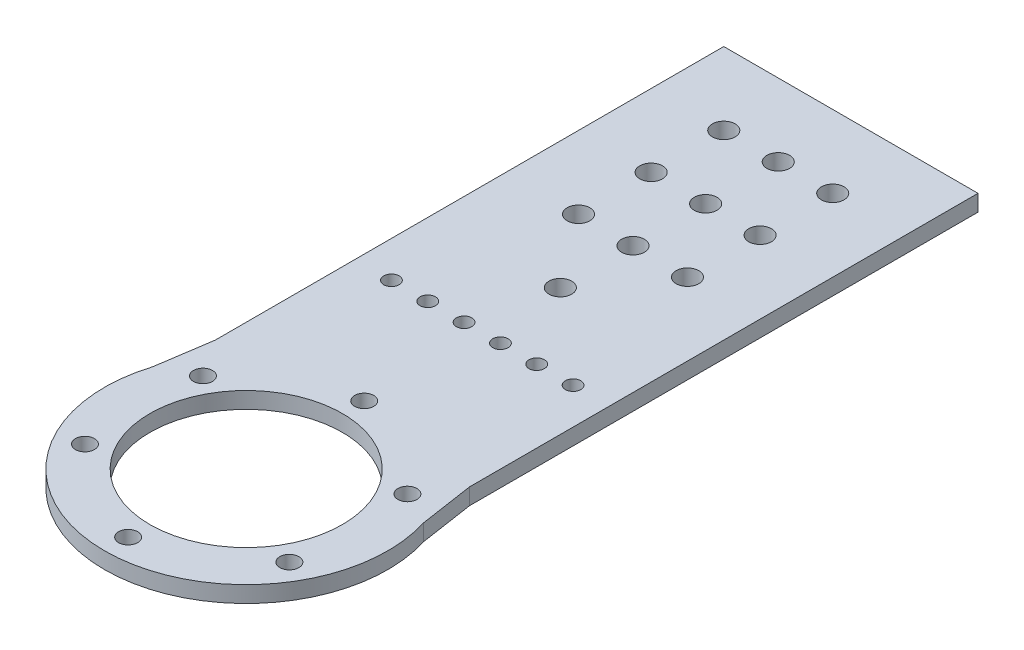
ISO-10303-21;
HEADER;
FILE_DESCRIPTION(('STEP AP214'),'2;1');
FILE_NAME('part.step','',(''),(''),'','','');
FILE_SCHEMA(('AUTOMOTIVE_DESIGN { 1 0 10303 214 1 1 1 1 }'));
ENDSEC;
DATA;
#1=APPLICATION_CONTEXT('core data for automotive mechanical design processes');
#2=APPLICATION_PROTOCOL_DEFINITION('international standard','automotive_design',2000,#1);
#3=PRODUCT_CONTEXT('',#1,'mechanical');
#4=PRODUCT('Part','Part','',(#3));
#5=PRODUCT_RELATED_PRODUCT_CATEGORY('part','',(#4));
#6=PRODUCT_DEFINITION_FORMATION('','',#4);
#7=PRODUCT_DEFINITION_CONTEXT('part definition',#1,'design');
#8=PRODUCT_DEFINITION('design','',#6,#7);
#9=PRODUCT_DEFINITION_SHAPE('','',#8);
#10=(LENGTH_UNIT() NAMED_UNIT(*) SI_UNIT(.MILLI.,.METRE.));
#11=(NAMED_UNIT(*) PLANE_ANGLE_UNIT() SI_UNIT($,.RADIAN.));
#12=(NAMED_UNIT(*) SI_UNIT($,.STERADIAN.) SOLID_ANGLE_UNIT());
#13=UNCERTAINTY_MEASURE_WITH_UNIT(LENGTH_MEASURE(1.E-05),#10,'distance_accuracy_value','');
#14=(GEOMETRIC_REPRESENTATION_CONTEXT(3) GLOBAL_UNCERTAINTY_ASSIGNED_CONTEXT((#13)) GLOBAL_UNIT_ASSIGNED_CONTEXT((#10,
#11,#12)) REPRESENTATION_CONTEXT('',''));
#15=CARTESIAN_POINT('',(0.,0.,0.));
#16=DIRECTION('',(0.,0.,1.));
#17=DIRECTION('',(1.,0.,0.));
#18=AXIS2_PLACEMENT_3D('',#15,#16,#17);
#19=CARTESIAN_POINT('',(5.,-2.25,-65.));
#20=DIRECTION('',(0.,1.,0.));
#21=DIRECTION('',(0.,0.,1.));
#22=AXIS2_PLACEMENT_3D('',#19,#20,#21);
#23=CYLINDRICAL_SURFACE('',#22,2.125);
#24=CARTESIAN_POINT('',(5.,2.25,-65.));
#25=DIRECTION('',(0.,1.,0.));
#26=DIRECTION('',(0.,0.,1.));
#27=AXIS2_PLACEMENT_3D('',#24,#25,#26);
#28=CIRCLE('',#27,2.125);
#29=CARTESIAN_POINT('',(5.,2.25,-62.875));
#30=VERTEX_POINT('',#29);
#31=EDGE_CURVE('E40',#30,#30,#28,.T.);
#32=ORIENTED_EDGE('',*,*,#31,.T.);
#33=EDGE_LOOP('',(#32));
#34=FACE_BOUND('',#33,.T.);
#35=CARTESIAN_POINT('',(5.,-2.25,-65.));
#36=DIRECTION('',(0.,1.,0.));
#37=DIRECTION('',(0.,0.,1.));
#38=AXIS2_PLACEMENT_3D('',#35,#36,#37);
#39=CIRCLE('',#38,2.125);
#40=CARTESIAN_POINT('',(5.,-2.25,-62.875));
#41=VERTEX_POINT('',#40);
#42=EDGE_CURVE('E11',#41,#41,#39,.T.);
#43=ORIENTED_EDGE('',*,*,#42,.F.);
#44=EDGE_LOOP('',(#43));
#45=FACE_BOUND('',#44,.T.);
#46=ADVANCED_FACE('F33',(#34,#45),#23,.F.);
#47=CARTESIAN_POINT('',(0.,-7.75,-86.5000000000001));
#48=DIRECTION('',(0.,1.,0.));
#49=DIRECTION('',(0.,0.,1.));
#50=AXIS2_PLACEMENT_3D('',#47,#48,#49);
#51=CYLINDRICAL_SURFACE('',#50,3.125);
#52=CARTESIAN_POINT('',(0.,2.25,-86.5000000000001));
#53=DIRECTION('',(0.,1.,0.));
#54=DIRECTION('',(0.,0.,1.));
#55=AXIS2_PLACEMENT_3D('',#52,#53,#54);
#56=CIRCLE('',#55,3.125);
#57=CARTESIAN_POINT('',(0.,2.25,-83.3750000000001));
#58=VERTEX_POINT('',#57);
#59=EDGE_CURVE('E150',#58,#58,#56,.T.);
#60=ORIENTED_EDGE('',*,*,#59,.T.);
#61=EDGE_LOOP('',(#60));
#62=FACE_BOUND('',#61,.T.);
#63=CARTESIAN_POINT('',(0.,-2.25,-86.5000000000001));
#64=DIRECTION('',(0.,1.,0.));
#65=DIRECTION('',(0.,0.,1.));
#66=AXIS2_PLACEMENT_3D('',#63,#64,#65);
#67=CIRCLE('',#66,3.125);
#68=CARTESIAN_POINT('',(0.,-2.25,-83.3750000000001));
#69=VERTEX_POINT('',#68);
#70=EDGE_CURVE('E153',#69,#69,#67,.T.);
#71=ORIENTED_EDGE('',*,*,#70,.F.);
#72=EDGE_LOOP('',(#71));
#73=FACE_BOUND('',#72,.T.);
#74=ADVANCED_FACE('F178',(#62,#73),#51,.F.);
#75=CARTESIAN_POINT('',(0.,-7.75,-106.5));
#76=DIRECTION('',(0.,1.,0.));
#77=DIRECTION('',(0.,0.,1.));
#78=AXIS2_PLACEMENT_3D('',#75,#76,#77);
#79=CYLINDRICAL_SURFACE('',#78,3.125);
#80=CARTESIAN_POINT('',(0.,2.25,-106.5));
#81=DIRECTION('',(0.,1.,0.));
#82=DIRECTION('',(0.,0.,1.));
#83=AXIS2_PLACEMENT_3D('',#80,#81,#82);
#84=CIRCLE('',#83,3.125);
#85=CARTESIAN_POINT('',(0.,2.25,-103.375));
#86=VERTEX_POINT('',#85);
#87=EDGE_CURVE('E139',#86,#86,#84,.T.);
#88=ORIENTED_EDGE('',*,*,#87,.T.);
#89=EDGE_LOOP('',(#88));
#90=FACE_BOUND('',#89,.T.);
#91=CARTESIAN_POINT('',(0.,-2.25,-106.5));
#92=DIRECTION('',(0.,1.,0.));
#93=DIRECTION('',(0.,0.,1.));
#94=AXIS2_PLACEMENT_3D('',#91,#92,#93);
#95=CIRCLE('',#94,3.125);
#96=CARTESIAN_POINT('',(0.,-2.25,-103.375));
#97=VERTEX_POINT('',#96);
#98=EDGE_CURVE('E147',#97,#97,#95,.T.);
#99=ORIENTED_EDGE('',*,*,#98,.F.);
#100=EDGE_LOOP('',(#99));
#101=FACE_BOUND('',#100,.T.);
#102=ADVANCED_FACE('F182',(#90,#101),#79,.F.);
#103=CARTESIAN_POINT('',(15.,-2.25,-106.5));
#104=DIRECTION('',(0.,1.,0.));
#105=DIRECTION('',(0.,0.,1.));
#106=AXIS2_PLACEMENT_3D('',#103,#104,#105);
#107=CYLINDRICAL_SURFACE('',#106,3.125);
#108=CARTESIAN_POINT('',(15.,2.25,-106.5));
#109=DIRECTION('',(0.,1.,0.));
#110=DIRECTION('',(0.,0.,1.));
#111=AXIS2_PLACEMENT_3D('',#108,#109,#110);
#112=CIRCLE('',#111,3.125);
#113=CARTESIAN_POINT('',(15.,2.25,-103.375));
#114=VERTEX_POINT('',#113);
#115=EDGE_CURVE('E133',#114,#114,#112,.T.);
#116=ORIENTED_EDGE('',*,*,#115,.T.);
#117=EDGE_LOOP('',(#116));
#118=FACE_BOUND('',#117,.T.);
#119=CARTESIAN_POINT('',(15.,-2.25,-106.5));
#120=DIRECTION('',(0.,1.,0.));
#121=DIRECTION('',(0.,0.,1.));
#122=AXIS2_PLACEMENT_3D('',#119,#120,#121);
#123=CIRCLE('',#122,3.125);
#124=CARTESIAN_POINT('',(15.,-2.25,-103.375));
#125=VERTEX_POINT('',#124);
#126=EDGE_CURVE('E136',#125,#125,#123,.T.);
#127=ORIENTED_EDGE('',*,*,#126,.F.);
#128=EDGE_LOOP('',(#127));
#129=FACE_BOUND('',#128,.T.);
#130=ADVANCED_FACE('F187',(#118,#129),#107,.F.);
#131=CARTESIAN_POINT('',(-15.,-2.25,-106.5));
#132=DIRECTION('',(0.,1.,0.));
#133=DIRECTION('',(0.,0.,1.));
#134=AXIS2_PLACEMENT_3D('',#131,#132,#133);
#135=CYLINDRICAL_SURFACE('',#134,3.125);
#136=CARTESIAN_POINT('',(-15.,2.25,-106.5));
#137=DIRECTION('',(0.,1.,0.));
#138=DIRECTION('',(0.,0.,1.));
#139=AXIS2_PLACEMENT_3D('',#136,#137,#138);
#140=CIRCLE('',#139,3.125);
#141=CARTESIAN_POINT('',(-15.,2.25,-103.375));
#142=VERTEX_POINT('',#141);
#143=EDGE_CURVE('E126',#142,#142,#140,.T.);
#144=ORIENTED_EDGE('',*,*,#143,.T.);
#145=EDGE_LOOP('',(#144));
#146=FACE_BOUND('',#145,.T.);
#147=CARTESIAN_POINT('',(-15.,-2.25,-106.5));
#148=DIRECTION('',(0.,1.,0.));
#149=DIRECTION('',(0.,0.,1.));
#150=AXIS2_PLACEMENT_3D('',#147,#148,#149);
#151=CIRCLE('',#150,3.125);
#152=CARTESIAN_POINT('',(-15.,-2.25,-103.375));
#153=VERTEX_POINT('',#152);
#154=EDGE_CURVE('E130',#153,#153,#151,.T.);
#155=ORIENTED_EDGE('',*,*,#154,.F.);
#156=EDGE_LOOP('',(#155));
#157=FACE_BOUND('',#156,.T.);
#158=ADVANCED_FACE('F172',(#146,#157),#135,.F.);
#159=CARTESIAN_POINT('',(0.,2.25,0.));
#160=DIRECTION('',(0.,-1.,0.));
#161=DIRECTION('',(0.,0.,-1.));
#162=AXIS2_PLACEMENT_3D('',#159,#160,#161);
#163=CYLINDRICAL_SURFACE('',#162,39.);
#164=DIRECTION('',(0.,-1.,0.));
#165=VECTOR('',#164,1.);
#166=CARTESIAN_POINT('',(37.262443438914,2.25,-11.5113122171946));
#167=LINE('',#166,#165);
#168=CARTESIAN_POINT('',(37.2624434389141,2.25,-11.5113122171945));
#169=VERTEX_POINT('',#168);
#170=CARTESIAN_POINT('',(37.2624434389141,-2.25,-11.5113122171945));
#171=VERTEX_POINT('',#170);
#172=EDGE_CURVE('E108',#169,#171,#167,.T.);
#173=ORIENTED_EDGE('',*,*,#172,.F.);
#174=CARTESIAN_POINT('',(0.,2.25,0.));
#175=DIRECTION('',(0.,1.,0.));
#176=DIRECTION('',(0.,0.,1.));
#177=AXIS2_PLACEMENT_3D('',#174,#175,#176);
#178=CIRCLE('',#177,39.);
#179=CARTESIAN_POINT('',(-37.262443438914,2.25,-11.5113122171946));
#180=VERTEX_POINT('',#179);
#181=EDGE_CURVE('E47',#180,#169,#178,.T.);
#182=ORIENTED_EDGE('',*,*,#181,.F.);
#183=DIRECTION('',(0.,-1.,0.));
#184=VECTOR('',#183,1.);
#185=CARTESIAN_POINT('',(-37.262443438914,2.25,-11.5113122171946));
#186=LINE('',#185,#184);
#187=CARTESIAN_POINT('',(-37.262443438914,-2.25,-11.5113122171946));
#188=VERTEX_POINT('',#187);
#189=EDGE_CURVE('E111',#188,#180,#186,.F.);
#190=ORIENTED_EDGE('',*,*,#189,.F.);
#191=CARTESIAN_POINT('',(0.,-2.25,0.));
#192=DIRECTION('',(0.,1.,0.));
#193=DIRECTION('',(0.,0.,1.));
#194=AXIS2_PLACEMENT_3D('',#191,#192,#193);
#195=CIRCLE('',#194,39.);
#196=EDGE_CURVE('E122',#188,#171,#195,.T.);
#197=ORIENTED_EDGE('',*,*,#196,.T.);
#198=EDGE_LOOP('',(#173,#182,#190,#197));
#199=FACE_BOUND('',#198,.T.);
#200=ADVANCED_FACE('F162',(#199),#163,.T.);
#201=CARTESIAN_POINT('',(0.,2.25,0.));
#202=DIRECTION('',(0.,1.,0.));
#203=DIRECTION('',(0.,0.,1.));
#204=AXIS2_PLACEMENT_3D('',#201,#202,#203);
#205=PLANE('',#204);
#206=CARTESIAN_POINT('',(-25.,2.25,-65.));
#207=DIRECTION('',(0.,1.,0.));
#208=DIRECTION('',(0.,0.,1.));
#209=AXIS2_PLACEMENT_3D('',#206,#207,#208);
#210=CIRCLE('',#209,2.125);
#211=CARTESIAN_POINT('',(-25.,2.25,-62.875));
#212=VERTEX_POINT('',#211);
#213=EDGE_CURVE('E481',#212,#212,#210,.F.);
#214=ORIENTED_EDGE('',*,*,#213,.T.);
#215=EDGE_LOOP('',(#214));
#216=FACE_BOUND('',#215,.T.);
#217=CARTESIAN_POINT('',(-15.,2.25,-65.));
#218=DIRECTION('',(0.,1.,0.));
#219=DIRECTION('',(0.,0.,1.));
#220=AXIS2_PLACEMENT_3D('',#217,#218,#219);
#221=CIRCLE('',#220,2.125);
#222=CARTESIAN_POINT('',(-15.,2.25,-62.875));
#223=VERTEX_POINT('',#222);
#224=EDGE_CURVE('E489',#223,#223,#221,.F.);
#225=ORIENTED_EDGE('',*,*,#224,.T.);
#226=EDGE_LOOP('',(#225));
#227=FACE_BOUND('',#226,.T.);
#228=CARTESIAN_POINT('',(-5.,2.25,-65.));
#229=DIRECTION('',(0.,1.,0.));
#230=DIRECTION('',(0.,0.,1.));
#231=AXIS2_PLACEMENT_3D('',#228,#229,#230);
#232=CIRCLE('',#231,2.125);
#233=CARTESIAN_POINT('',(-5.,2.25,-62.875));
#234=VERTEX_POINT('',#233);
#235=EDGE_CURVE('E485',#234,#234,#232,.F.);
#236=ORIENTED_EDGE('',*,*,#235,.T.);
#237=EDGE_LOOP('',(#236));
#238=FACE_BOUND('',#237,.T.);
#239=CARTESIAN_POINT('',(15.,2.25,-65.));
#240=DIRECTION('',(0.,1.,0.));
#241=DIRECTION('',(0.,0.,1.));
#242=AXIS2_PLACEMENT_3D('',#239,#240,#241);
#243=CIRCLE('',#242,2.125);
#244=CARTESIAN_POINT('',(15.,2.25,-62.875));
#245=VERTEX_POINT('',#244);
#246=EDGE_CURVE('E500',#245,#245,#243,.T.);
#247=ORIENTED_EDGE('',*,*,#246,.F.);
#248=EDGE_LOOP('',(#247));
#249=FACE_BOUND('',#248,.T.);
#250=CARTESIAN_POINT('',(25.,2.25,-65.));
#251=DIRECTION('',(0.,1.,0.));
#252=DIRECTION('',(0.,0.,1.));
#253=AXIS2_PLACEMENT_3D('',#250,#251,#252);
#254=CIRCLE('',#253,2.125);
#255=CARTESIAN_POINT('',(25.,2.25,-62.875));
#256=VERTEX_POINT('',#255);
#257=EDGE_CURVE('E509',#256,#256,#254,.T.);
#258=ORIENTED_EDGE('',*,*,#257,.F.);
#259=EDGE_LOOP('',(#258));
#260=FACE_BOUND('',#259,.T.);
#261=CARTESIAN_POINT('',(0.,2.25,-126.5));
#262=DIRECTION('',(0.,1.,0.));
#263=DIRECTION('',(0.,0.,1.));
#264=AXIS2_PLACEMENT_3D('',#261,#262,#263);
#265=CIRCLE('',#264,3.125);
#266=CARTESIAN_POINT('',(0.,2.25,-123.375));
#267=VERTEX_POINT('',#266);
#268=EDGE_CURVE('E512',#267,#267,#265,.T.);
#269=ORIENTED_EDGE('',*,*,#268,.F.);
#270=EDGE_LOOP('',(#269));
#271=FACE_BOUND('',#270,.T.);
#272=CARTESIAN_POINT('',(0.,2.25,-146.5));
#273=DIRECTION('',(0.,1.,0.));
#274=DIRECTION('',(0.,0.,1.));
#275=AXIS2_PLACEMENT_3D('',#272,#273,#274);
#276=CIRCLE('',#275,3.125);
#277=CARTESIAN_POINT('',(0.,2.25,-143.375));
#278=VERTEX_POINT('',#277);
#279=EDGE_CURVE('E144',#278,#278,#276,.T.);
#280=ORIENTED_EDGE('',*,*,#279,.F.);
#281=EDGE_LOOP('',(#280));
#282=FACE_BOUND('',#281,.T.);
#283=CARTESIAN_POINT('',(15.,2.25,-126.5));
#284=DIRECTION('',(0.,1.,0.));
#285=DIRECTION('',(0.,0.,1.));
#286=AXIS2_PLACEMENT_3D('',#283,#284,#285);
#287=CIRCLE('',#286,3.125);
#288=CARTESIAN_POINT('',(15.,2.25,-123.375));
#289=VERTEX_POINT('',#288);
#290=EDGE_CURVE('E143',#289,#289,#287,.T.);
#291=ORIENTED_EDGE('',*,*,#290,.F.);
#292=EDGE_LOOP('',(#291));
#293=FACE_BOUND('',#292,.T.);
#294=CARTESIAN_POINT('',(-15.,2.25,-126.5));
#295=DIRECTION('',(0.,1.,0.));
#296=DIRECTION('',(0.,0.,1.));
#297=AXIS2_PLACEMENT_3D('',#294,#295,#296);
#298=CIRCLE('',#297,3.125);
#299=CARTESIAN_POINT('',(-15.,2.25,-123.375));
#300=VERTEX_POINT('',#299);
#301=EDGE_CURVE('E525',#300,#300,#298,.T.);
#302=ORIENTED_EDGE('',*,*,#301,.F.);
#303=EDGE_LOOP('',(#302));
#304=FACE_BOUND('',#303,.T.);
#305=CARTESIAN_POINT('',(-15.,2.25,-146.5));
#306=DIRECTION('',(0.,1.,0.));
#307=DIRECTION('',(0.,0.,1.));
#308=AXIS2_PLACEMENT_3D('',#305,#306,#307);
#309=CIRCLE('',#308,3.125);
#310=CARTESIAN_POINT('',(-15.,2.25,-143.375));
#311=VERTEX_POINT('',#310);
#312=EDGE_CURVE('E540',#311,#311,#309,.T.);
#313=ORIENTED_EDGE('',*,*,#312,.F.);
#314=EDGE_LOOP('',(#313));
#315=FACE_BOUND('',#314,.T.);
#316=CARTESIAN_POINT('',(15.,2.25,-146.5));
#317=DIRECTION('',(0.,1.,0.));
#318=DIRECTION('',(0.,0.,1.));
#319=AXIS2_PLACEMENT_3D('',#316,#317,#318);
#320=CIRCLE('',#319,3.125);
#321=CARTESIAN_POINT('',(15.,2.25,-143.375));
#322=VERTEX_POINT('',#321);
#323=EDGE_CURVE('E535',#322,#322,#320,.T.);
#324=ORIENTED_EDGE('',*,*,#323,.F.);
#325=EDGE_LOOP('',(#324));
#326=FACE_BOUND('',#325,.T.);
#327=CARTESIAN_POINT('',(28.1458256229941,2.25,-16.2500000000003));
#328=DIRECTION('',(0.,1.,0.));
#329=DIRECTION('',(-0.866025403784433,0.,0.50000000000001));
#330=AXIS2_PLACEMENT_3D('',#327,#328,#329);
#331=CIRCLE('',#330,2.625);
#332=CARTESIAN_POINT('',(25.8725089380599,2.25,-14.9375000000003));
#333=VERTEX_POINT('',#332);
#334=EDGE_CURVE('E543',#333,#333,#331,.T.);
#335=ORIENTED_EDGE('',*,*,#334,.F.);
#336=EDGE_LOOP('',(#335));
#337=FACE_BOUND('',#336,.T.);
#338=CARTESIAN_POINT('',(28.1458256229944,2.25,16.2499999999997));
#339=DIRECTION('',(0.,1.,0.));
#340=DIRECTION('',(-0.866025403784443,0.,-0.499999999999992));
#341=AXIS2_PLACEMENT_3D('',#338,#339,#340);
#342=CIRCLE('',#341,2.625);
#343=CARTESIAN_POINT('',(25.8725089380602,2.25,14.9374999999998));
#344=VERTEX_POINT('',#343);
#345=EDGE_CURVE('E558',#344,#344,#342,.T.);
#346=ORIENTED_EDGE('',*,*,#345,.F.);
#347=EDGE_LOOP('',(#346));
#348=FACE_BOUND('',#347,.T.);
#349=CARTESIAN_POINT('',(0.,2.25,32.5));
#350=DIRECTION('',(0.,1.,0.));
#351=DIRECTION('',(0.,0.,-1.));
#352=AXIS2_PLACEMENT_3D('',#349,#350,#351);
#353=CIRCLE('',#352,2.625);
#354=CARTESIAN_POINT('',(0.,2.25,29.875));
#355=VERTEX_POINT('',#354);
#356=EDGE_CURVE('E552',#355,#355,#353,.T.);
#357=ORIENTED_EDGE('',*,*,#356,.F.);
#358=EDGE_LOOP('',(#357));
#359=FACE_BOUND('',#358,.T.);
#360=CARTESIAN_POINT('',(-28.1458256229942,2.25,16.2500000000001));
#361=DIRECTION('',(0.,1.,0.));
#362=DIRECTION('',(0.866025403784436,0.,-0.500000000000004));
#363=AXIS2_PLACEMENT_3D('',#360,#361,#362);
#364=CIRCLE('',#363,2.625);
#365=CARTESIAN_POINT('',(-25.87250893806,2.25,14.9375000000001));
#366=VERTEX_POINT('',#365);
#367=EDGE_CURVE('E544',#366,#366,#364,.T.);
#368=ORIENTED_EDGE('',*,*,#367,.F.);
#369=EDGE_LOOP('',(#368));
#370=FACE_BOUND('',#369,.T.);
#371=CARTESIAN_POINT('',(-28.1458256229943,2.25,-16.2499999999999));
#372=DIRECTION('',(0.,1.,0.));
#373=DIRECTION('',(0.86602540378444,0.,0.499999999999998));
#374=AXIS2_PLACEMENT_3D('',#371,#372,#373);
#375=CIRCLE('',#374,2.625);
#376=CARTESIAN_POINT('',(-25.8725089380601,2.25,-14.9374999999999));
#377=VERTEX_POINT('',#376);
#378=EDGE_CURVE('E551',#377,#377,#375,.T.);
#379=ORIENTED_EDGE('',*,*,#378,.F.);
#380=EDGE_LOOP('',(#379));
#381=FACE_BOUND('',#380,.T.);
#382=CARTESIAN_POINT('',(0.,2.25,-32.5));
#383=DIRECTION('',(0.,1.,0.));
#384=DIRECTION('',(0.,0.,1.));
#385=AXIS2_PLACEMENT_3D('',#382,#383,#384);
#386=CIRCLE('',#385,2.625);
#387=CARTESIAN_POINT('',(0.,2.25,-29.875));
#388=VERTEX_POINT('',#387);
#389=EDGE_CURVE('E573',#388,#388,#386,.T.);
#390=ORIENTED_EDGE('',*,*,#389,.F.);
#391=EDGE_LOOP('',(#390));
#392=FACE_BOUND('',#391,.T.);
#393=DIRECTION('',(-0.149252692330049,0.,0.988799086686588));
#394=VECTOR('',#393,1.);
#395=CARTESIAN_POINT('',(-35.,2.25,-26.5));
#396=LINE('',#395,#394);
#397=CARTESIAN_POINT('',(-35.,2.25,-26.5));
#398=VERTEX_POINT('',#397);
#399=EDGE_CURVE('E92',#398,#180,#396,.T.);
#400=ORIENTED_EDGE('',*,*,#399,.T.);
#401=ORIENTED_EDGE('',*,*,#181,.T.);
#402=DIRECTION('',(-0.149252692330051,0.,-0.988799086686588));
#403=VECTOR('',#402,1.);
#404=CARTESIAN_POINT('',(35.,2.25,-26.5));
#405=LINE('',#404,#403);
#406=CARTESIAN_POINT('',(35.,2.25,-26.5));
#407=VERTEX_POINT('',#406);
#408=EDGE_CURVE('E580',#169,#407,#405,.T.);
#409=ORIENTED_EDGE('',*,*,#408,.T.);
#410=DIRECTION('',(0.,0.,-1.));
#411=VECTOR('',#410,1.);
#412=CARTESIAN_POINT('',(35.,2.25,-166.5));
#413=LINE('',#412,#411);
#414=CARTESIAN_POINT('',(35.,2.25,-166.5));
#415=VERTEX_POINT('',#414);
#416=EDGE_CURVE('E99',#407,#415,#413,.T.);
#417=ORIENTED_EDGE('',*,*,#416,.T.);
#418=DIRECTION('',(-1.,0.,0.));
#419=VECTOR('',#418,1.);
#420=CARTESIAN_POINT('',(-35.,2.25,-166.5));
#421=LINE('',#420,#419);
#422=CARTESIAN_POINT('',(-35.,2.25,-166.5));
#423=VERTEX_POINT('',#422);
#424=EDGE_CURVE('E93',#415,#423,#421,.T.);
#425=ORIENTED_EDGE('',*,*,#424,.T.);
#426=DIRECTION('',(0.,0.,1.));
#427=VECTOR('',#426,1.);
#428=CARTESIAN_POINT('',(-35.,2.25,-166.5));
#429=LINE('',#428,#427);
#430=EDGE_CURVE('E83',#423,#398,#429,.T.);
#431=ORIENTED_EDGE('',*,*,#430,.T.);
#432=EDGE_LOOP('',(#400,#401,#409,#417,#425,#431));
#433=FACE_BOUND('',#432,.T.);
#434=CARTESIAN_POINT('',(0.,2.25,0.));
#435=DIRECTION('',(0.,1.,0.));
#436=DIRECTION('',(0.,0.,1.));
#437=AXIS2_PLACEMENT_3D('',#434,#435,#436);
#438=CIRCLE('',#437,26.5);
#439=CARTESIAN_POINT('',(0.,2.25,26.5));
#440=VERTEX_POINT('',#439);
#441=EDGE_CURVE('E119',#440,#440,#438,.T.);
#442=ORIENTED_EDGE('',*,*,#441,.F.);
#443=EDGE_LOOP('',(#442));
#444=FACE_BOUND('',#443,.T.);
#445=ORIENTED_EDGE('',*,*,#143,.F.);
#446=EDGE_LOOP('',(#445));
#447=FACE_BOUND('',#446,.T.);
#448=ORIENTED_EDGE('',*,*,#115,.F.);
#449=EDGE_LOOP('',(#448));
#450=FACE_BOUND('',#449,.T.);
#451=ORIENTED_EDGE('',*,*,#87,.F.);
#452=EDGE_LOOP('',(#451));
#453=FACE_BOUND('',#452,.T.);
#454=ORIENTED_EDGE('',*,*,#59,.F.);
#455=EDGE_LOOP('',(#454));
#456=FACE_BOUND('',#455,.T.);
#457=ORIENTED_EDGE('',*,*,#31,.F.);
#458=EDGE_LOOP('',(#457));
#459=FACE_BOUND('',#458,.T.);
#460=ADVANCED_FACE('F96',(#216,#227,#238,#249,#260,#271,#282,#293,#304,#315,#326,#337,#348,#359,
#370,#381,#392,#433,#444,#447,#450,#453,#456,#459),#205,.T.);
#461=CARTESIAN_POINT('',(0.,-2.25,0.));
#462=DIRECTION('',(0.,1.,0.));
#463=DIRECTION('',(0.,0.,1.));
#464=AXIS2_PLACEMENT_3D('',#461,#462,#463);
#465=PLANE('',#464);
#466=CARTESIAN_POINT('',(-25.,-2.25,-65.));
#467=DIRECTION('',(0.,-1.,0.));
#468=DIRECTION('',(0.,0.,1.));
#469=AXIS2_PLACEMENT_3D('',#466,#467,#468);
#470=CIRCLE('',#469,2.125);
#471=CARTESIAN_POINT('',(-25.,-2.25,-62.875));
#472=VERTEX_POINT('',#471);
#473=EDGE_CURVE('E484',#472,#472,#470,.T.);
#474=ORIENTED_EDGE('',*,*,#473,.F.);
#475=EDGE_LOOP('',(#474));
#476=FACE_BOUND('',#475,.T.);
#477=CARTESIAN_POINT('',(-15.,-2.25,-65.));
#478=DIRECTION('',(0.,-1.,0.));
#479=DIRECTION('',(0.,0.,1.));
#480=AXIS2_PLACEMENT_3D('',#477,#478,#479);
#481=CIRCLE('',#480,2.125);
#482=CARTESIAN_POINT('',(-15.,-2.25,-62.875));
#483=VERTEX_POINT('',#482);
#484=EDGE_CURVE('E486',#483,#483,#481,.T.);
#485=ORIENTED_EDGE('',*,*,#484,.F.);
#486=EDGE_LOOP('',(#485));
#487=FACE_BOUND('',#486,.T.);
#488=CARTESIAN_POINT('',(-5.,-2.25,-65.));
#489=DIRECTION('',(0.,-1.,0.));
#490=DIRECTION('',(0.,0.,1.));
#491=AXIS2_PLACEMENT_3D('',#488,#489,#490);
#492=CIRCLE('',#491,2.125);
#493=CARTESIAN_POINT('',(-5.,-2.25,-62.875));
#494=VERTEX_POINT('',#493);
#495=EDGE_CURVE('E492',#494,#494,#492,.T.);
#496=ORIENTED_EDGE('',*,*,#495,.F.);
#497=EDGE_LOOP('',(#496));
#498=FACE_BOUND('',#497,.T.);
#499=CARTESIAN_POINT('',(15.,-2.25,-65.));
#500=DIRECTION('',(0.,1.,0.));
#501=DIRECTION('',(0.,0.,1.));
#502=AXIS2_PLACEMENT_3D('',#499,#500,#501);
#503=CIRCLE('',#502,2.125);
#504=CARTESIAN_POINT('',(15.,-2.25,-62.875));
#505=VERTEX_POINT('',#504);
#506=EDGE_CURVE('E503',#505,#505,#503,.T.);
#507=ORIENTED_EDGE('',*,*,#506,.T.);
#508=EDGE_LOOP('',(#507));
#509=FACE_BOUND('',#508,.T.);
#510=CARTESIAN_POINT('',(25.,-2.25,-65.));
#511=DIRECTION('',(0.,1.,0.));
#512=DIRECTION('',(0.,0.,1.));
#513=AXIS2_PLACEMENT_3D('',#510,#511,#512);
#514=CIRCLE('',#513,2.125);
#515=CARTESIAN_POINT('',(25.,-2.25,-62.875));
#516=VERTEX_POINT('',#515);
#517=EDGE_CURVE('E506',#516,#516,#514,.T.);
#518=ORIENTED_EDGE('',*,*,#517,.T.);
#519=EDGE_LOOP('',(#518));
#520=FACE_BOUND('',#519,.T.);
#521=CARTESIAN_POINT('',(0.,-2.25,-126.5));
#522=DIRECTION('',(0.,1.,0.));
#523=DIRECTION('',(0.,0.,1.));
#524=AXIS2_PLACEMENT_3D('',#521,#522,#523);
#525=CIRCLE('',#524,3.125);
#526=CARTESIAN_POINT('',(0.,-2.25,-123.375));
#527=VERTEX_POINT('',#526);
#528=EDGE_CURVE('E515',#527,#527,#525,.T.);
#529=ORIENTED_EDGE('',*,*,#528,.T.);
#530=EDGE_LOOP('',(#529));
#531=FACE_BOUND('',#530,.T.);
#532=CARTESIAN_POINT('',(0.,-2.25,-146.5));
#533=DIRECTION('',(0.,1.,0.));
#534=DIRECTION('',(0.,0.,1.));
#535=AXIS2_PLACEMENT_3D('',#532,#533,#534);
#536=CIRCLE('',#535,3.125);
#537=CARTESIAN_POINT('',(0.,-2.25,-143.375));
#538=VERTEX_POINT('',#537);
#539=EDGE_CURVE('E140',#538,#538,#536,.T.);
#540=ORIENTED_EDGE('',*,*,#539,.T.);
#541=EDGE_LOOP('',(#540));
#542=FACE_BOUND('',#541,.T.);
#543=CARTESIAN_POINT('',(15.,-2.25,-126.5));
#544=DIRECTION('',(0.,1.,0.));
#545=DIRECTION('',(0.,0.,1.));
#546=AXIS2_PLACEMENT_3D('',#543,#544,#545);
#547=CIRCLE('',#546,3.125);
#548=CARTESIAN_POINT('',(15.,-2.25,-123.375));
#549=VERTEX_POINT('',#548);
#550=EDGE_CURVE('E522',#549,#549,#547,.T.);
#551=ORIENTED_EDGE('',*,*,#550,.T.);
#552=EDGE_LOOP('',(#551));
#553=FACE_BOUND('',#552,.T.);
#554=CARTESIAN_POINT('',(-15.,-2.25,-126.5));
#555=DIRECTION('',(0.,1.,0.));
#556=DIRECTION('',(0.,0.,1.));
#557=AXIS2_PLACEMENT_3D('',#554,#555,#556);
#558=CIRCLE('',#557,3.125);
#559=CARTESIAN_POINT('',(-15.,-2.25,-123.375));
#560=VERTEX_POINT('',#559);
#561=EDGE_CURVE('E528',#560,#560,#558,.T.);
#562=ORIENTED_EDGE('',*,*,#561,.T.);
#563=EDGE_LOOP('',(#562));
#564=FACE_BOUND('',#563,.T.);
#565=CARTESIAN_POINT('',(-15.,-2.25,-146.5));
#566=DIRECTION('',(0.,1.,0.));
#567=DIRECTION('',(0.,0.,1.));
#568=AXIS2_PLACEMENT_3D('',#565,#566,#567);
#569=CIRCLE('',#568,3.125);
#570=CARTESIAN_POINT('',(-15.,-2.25,-143.375));
#571=VERTEX_POINT('',#570);
#572=EDGE_CURVE('E532',#571,#571,#569,.T.);
#573=ORIENTED_EDGE('',*,*,#572,.T.);
#574=EDGE_LOOP('',(#573));
#575=FACE_BOUND('',#574,.T.);
#576=CARTESIAN_POINT('',(15.,-2.25,-146.5));
#577=DIRECTION('',(0.,1.,0.));
#578=DIRECTION('',(0.,0.,1.));
#579=AXIS2_PLACEMENT_3D('',#576,#577,#578);
#580=CIRCLE('',#579,3.125);
#581=CARTESIAN_POINT('',(15.,-2.25,-143.375));
#582=VERTEX_POINT('',#581);
#583=EDGE_CURVE('E531',#582,#582,#580,.T.);
#584=ORIENTED_EDGE('',*,*,#583,.T.);
#585=EDGE_LOOP('',(#584));
#586=FACE_BOUND('',#585,.T.);
#587=CARTESIAN_POINT('',(28.1458256229941,-2.25,-16.2500000000003));
#588=DIRECTION('',(0.,1.,0.));
#589=DIRECTION('',(-0.866025403784433,0.,0.50000000000001));
#590=AXIS2_PLACEMENT_3D('',#587,#588,#589);
#591=CIRCLE('',#590,2.625);
#592=CARTESIAN_POINT('',(25.8725089380599,-2.25,-14.9375000000003));
#593=VERTEX_POINT('',#592);
#594=EDGE_CURVE('E561',#593,#593,#591,.T.);
#595=ORIENTED_EDGE('',*,*,#594,.T.);
#596=EDGE_LOOP('',(#595));
#597=FACE_BOUND('',#596,.T.);
#598=CARTESIAN_POINT('',(28.1458256229944,-2.25,16.2499999999997));
#599=DIRECTION('',(0.,1.,0.));
#600=DIRECTION('',(-0.866025403784443,0.,-0.499999999999992));
#601=AXIS2_PLACEMENT_3D('',#598,#599,#600);
#602=CIRCLE('',#601,2.625);
#603=CARTESIAN_POINT('',(25.8725089380602,-2.25,14.9374999999998));
#604=VERTEX_POINT('',#603);
#605=EDGE_CURVE('E555',#604,#604,#602,.T.);
#606=ORIENTED_EDGE('',*,*,#605,.T.);
#607=EDGE_LOOP('',(#606));
#608=FACE_BOUND('',#607,.T.);
#609=CARTESIAN_POINT('',(0.,-2.25,32.5));
#610=DIRECTION('',(0.,1.,0.));
#611=DIRECTION('',(0.,0.,-1.));
#612=AXIS2_PLACEMENT_3D('',#609,#610,#611);
#613=CIRCLE('',#612,2.625);
#614=CARTESIAN_POINT('',(0.,-2.25,29.875));
#615=VERTEX_POINT('',#614);
#616=EDGE_CURVE('E548',#615,#615,#613,.T.);
#617=ORIENTED_EDGE('',*,*,#616,.T.);
#618=EDGE_LOOP('',(#617));
#619=FACE_BOUND('',#618,.T.);
#620=CARTESIAN_POINT('',(-28.1458256229942,-2.25,16.2500000000001));
#621=DIRECTION('',(0.,1.,0.));
#622=DIRECTION('',(0.866025403784436,0.,-0.500000000000004));
#623=AXIS2_PLACEMENT_3D('',#620,#621,#622);
#624=CIRCLE('',#623,2.625);
#625=CARTESIAN_POINT('',(-25.87250893806,-2.25,14.9375000000001));
#626=VERTEX_POINT('',#625);
#627=EDGE_CURVE('E547',#626,#626,#624,.T.);
#628=ORIENTED_EDGE('',*,*,#627,.T.);
#629=EDGE_LOOP('',(#628));
#630=FACE_BOUND('',#629,.T.);
#631=CARTESIAN_POINT('',(-28.1458256229943,-2.25,-16.2499999999999));
#632=DIRECTION('',(0.,1.,0.));
#633=DIRECTION('',(0.86602540378444,0.,0.499999999999998));
#634=AXIS2_PLACEMENT_3D('',#631,#632,#633);
#635=CIRCLE('',#634,2.625);
#636=CARTESIAN_POINT('',(-25.8725089380601,-2.25,-14.9374999999999));
#637=VERTEX_POINT('',#636);
#638=EDGE_CURVE('E570',#637,#637,#635,.T.);
#639=ORIENTED_EDGE('',*,*,#638,.T.);
#640=EDGE_LOOP('',(#639));
#641=FACE_BOUND('',#640,.T.);
#642=CARTESIAN_POINT('',(0.,-2.25,-32.5));
#643=DIRECTION('',(0.,1.,0.));
#644=DIRECTION('',(0.,0.,1.));
#645=AXIS2_PLACEMENT_3D('',#642,#643,#644);
#646=CIRCLE('',#645,2.625);
#647=CARTESIAN_POINT('',(0.,-2.25,-29.875));
#648=VERTEX_POINT('',#647);
#649=EDGE_CURVE('E576',#648,#648,#646,.T.);
#650=ORIENTED_EDGE('',*,*,#649,.T.);
#651=EDGE_LOOP('',(#650));
#652=FACE_BOUND('',#651,.T.);
#653=ORIENTED_EDGE('',*,*,#196,.F.);
#654=DIRECTION('',(-0.149252692330049,0.,0.988799086686588));
#655=VECTOR('',#654,1.);
#656=CARTESIAN_POINT('',(-35.,-2.25,-26.5));
#657=LINE('',#656,#655);
#658=CARTESIAN_POINT('',(-35.,-2.25,-26.5));
#659=VERTEX_POINT('',#658);
#660=EDGE_CURVE('E587',#659,#188,#657,.T.);
#661=ORIENTED_EDGE('',*,*,#660,.F.);
#662=DIRECTION('',(0.,0.,1.));
#663=VECTOR('',#662,1.);
#664=CARTESIAN_POINT('',(-35.,-2.25,-166.5));
#665=LINE('',#664,#663);
#666=CARTESIAN_POINT('',(-35.,-2.25,-166.5));
#667=VERTEX_POINT('',#666);
#668=EDGE_CURVE('E585',#667,#659,#665,.T.);
#669=ORIENTED_EDGE('',*,*,#668,.F.);
#670=DIRECTION('',(-1.,0.,0.));
#671=VECTOR('',#670,1.);
#672=CARTESIAN_POINT('',(-35.,-2.25,-166.5));
#673=LINE('',#672,#671);
#674=CARTESIAN_POINT('',(35.,-2.25,-166.5));
#675=VERTEX_POINT('',#674);
#676=EDGE_CURVE('E107',#675,#667,#673,.T.);
#677=ORIENTED_EDGE('',*,*,#676,.F.);
#678=DIRECTION('',(0.,0.,-1.));
#679=VECTOR('',#678,1.);
#680=CARTESIAN_POINT('',(35.,-2.25,-166.5));
#681=LINE('',#680,#679);
#682=CARTESIAN_POINT('',(35.,-2.25,-26.5));
#683=VERTEX_POINT('',#682);
#684=EDGE_CURVE('E103',#683,#675,#681,.T.);
#685=ORIENTED_EDGE('',*,*,#684,.F.);
#686=DIRECTION('',(-0.149252692330051,0.,-0.988799086686588));
#687=VECTOR('',#686,1.);
#688=CARTESIAN_POINT('',(35.,-2.25,-26.5));
#689=LINE('',#688,#687);
#690=EDGE_CURVE('E590',#171,#683,#689,.T.);
#691=ORIENTED_EDGE('',*,*,#690,.F.);
#692=EDGE_LOOP('',(#653,#661,#669,#677,#685,#691));
#693=FACE_BOUND('',#692,.T.);
#694=CARTESIAN_POINT('',(0.,-2.25,0.));
#695=DIRECTION('',(0.,1.,0.));
#696=DIRECTION('',(0.,0.,1.));
#697=AXIS2_PLACEMENT_3D('',#694,#695,#696);
#698=CIRCLE('',#697,26.5);
#699=CARTESIAN_POINT('',(0.,-2.25,26.5));
#700=VERTEX_POINT('',#699);
#701=EDGE_CURVE('E118',#700,#700,#698,.T.);
#702=ORIENTED_EDGE('',*,*,#701,.T.);
#703=EDGE_LOOP('',(#702));
#704=FACE_BOUND('',#703,.T.);
#705=ORIENTED_EDGE('',*,*,#154,.T.);
#706=EDGE_LOOP('',(#705));
#707=FACE_BOUND('',#706,.T.);
#708=ORIENTED_EDGE('',*,*,#126,.T.);
#709=EDGE_LOOP('',(#708));
#710=FACE_BOUND('',#709,.T.);
#711=ORIENTED_EDGE('',*,*,#98,.T.);
#712=EDGE_LOOP('',(#711));
#713=FACE_BOUND('',#712,.T.);
#714=ORIENTED_EDGE('',*,*,#70,.T.);
#715=EDGE_LOOP('',(#714));
#716=FACE_BOUND('',#715,.T.);
#717=ORIENTED_EDGE('',*,*,#42,.T.);
#718=EDGE_LOOP('',(#717));
#719=FACE_BOUND('',#718,.T.);
#720=ADVANCED_FACE('F161',(#476,#487,#498,#509,#520,#531,#542,#553,#564,#575,#586,#597,#608,
#619,#630,#641,#652,#693,#704,#707,#710,#713,#716,#719),#465,.F.);
#721=CARTESIAN_POINT('',(0.,2.25,0.));
#722=DIRECTION('',(0.,-1.,0.));
#723=DIRECTION('',(0.,0.,-1.));
#724=AXIS2_PLACEMENT_3D('',#721,#722,#723);
#725=CYLINDRICAL_SURFACE('',#724,26.5);
#726=ORIENTED_EDGE('',*,*,#701,.F.);
#727=EDGE_LOOP('',(#726));
#728=FACE_BOUND('',#727,.T.);
#729=ORIENTED_EDGE('',*,*,#441,.T.);
#730=EDGE_LOOP('',(#729));
#731=FACE_BOUND('',#730,.T.);
#732=ADVANCED_FACE('F169',(#728,#731),#725,.F.);
#733=CARTESIAN_POINT('',(-35.,2.25,-26.5));
#734=DIRECTION('',(0.988799086686589,0.,0.149252692330049));
#735=DIRECTION('',(0.149252692330049,0.,-0.988799086686589));
#736=AXIS2_PLACEMENT_3D('',#733,#734,#735);
#737=PLANE('',#736);
#738=ORIENTED_EDGE('',*,*,#660,.T.);
#739=ORIENTED_EDGE('',*,*,#189,.T.);
#740=ORIENTED_EDGE('',*,*,#399,.F.);
#741=DIRECTION('',(0.,-1.,0.));
#742=VECTOR('',#741,1.);
#743=CARTESIAN_POINT('',(-35.,2.25,-26.5));
#744=LINE('',#743,#742);
#745=EDGE_CURVE('E90',#398,#659,#744,.T.);
#746=ORIENTED_EDGE('',*,*,#745,.T.);
#747=EDGE_LOOP('',(#738,#739,#740,#746));
#748=FACE_BOUND('',#747,.T.);
#749=ADVANCED_FACE('F238',(#748),#737,.F.);
#750=CARTESIAN_POINT('',(35.,2.25,-26.5));
#751=DIRECTION('',(-0.988799086686588,0.,0.149252692330051));
#752=DIRECTION('',(0.149252692330051,0.,0.988799086686588));
#753=AXIS2_PLACEMENT_3D('',#750,#751,#752);
#754=PLANE('',#753);
#755=ORIENTED_EDGE('',*,*,#408,.F.);
#756=ORIENTED_EDGE('',*,*,#172,.T.);
#757=ORIENTED_EDGE('',*,*,#690,.T.);
#758=DIRECTION('',(0.,-1.,0.));
#759=VECTOR('',#758,1.);
#760=CARTESIAN_POINT('',(35.,2.25,-26.5));
#761=LINE('',#760,#759);
#762=EDGE_CURVE('E113',#407,#683,#761,.T.);
#763=ORIENTED_EDGE('',*,*,#762,.F.);
#764=EDGE_LOOP('',(#755,#756,#757,#763));
#765=FACE_BOUND('',#764,.T.);
#766=ADVANCED_FACE('F249',(#765),#754,.F.);
#767=CARTESIAN_POINT('',(-35.,2.25,-166.5));
#768=DIRECTION('',(0.,0.,1.));
#769=DIRECTION('',(1.,0.,0.));
#770=AXIS2_PLACEMENT_3D('',#767,#768,#769);
#771=PLANE('',#770);
#772=ORIENTED_EDGE('',*,*,#676,.T.);
#773=DIRECTION('',(0.,-1.,0.));
#774=VECTOR('',#773,1.);
#775=CARTESIAN_POINT('',(-35.,2.25,-166.5));
#776=LINE('',#775,#774);
#777=EDGE_CURVE('E87',#423,#667,#776,.T.);
#778=ORIENTED_EDGE('',*,*,#777,.F.);
#779=ORIENTED_EDGE('',*,*,#424,.F.);
#780=DIRECTION('',(0.,-1.,0.));
#781=VECTOR('',#780,1.);
#782=CARTESIAN_POINT('',(35.,2.25,-166.5));
#783=LINE('',#782,#781);
#784=EDGE_CURVE('E583',#415,#675,#783,.T.);
#785=ORIENTED_EDGE('',*,*,#784,.T.);
#786=EDGE_LOOP('',(#772,#778,#779,#785));
#787=FACE_BOUND('',#786,.T.);
#788=ADVANCED_FACE('F105',(#787),#771,.F.);
#789=CARTESIAN_POINT('',(-35.,2.25,-166.5));
#790=DIRECTION('',(1.,0.,0.));
#791=DIRECTION('',(0.,0.,-1.));
#792=AXIS2_PLACEMENT_3D('',#789,#790,#791);
#793=PLANE('',#792);
#794=ORIENTED_EDGE('',*,*,#668,.T.);
#795=ORIENTED_EDGE('',*,*,#745,.F.);
#796=ORIENTED_EDGE('',*,*,#430,.F.);
#797=ORIENTED_EDGE('',*,*,#777,.T.);
#798=EDGE_LOOP('',(#794,#795,#796,#797));
#799=FACE_BOUND('',#798,.T.);
#800=ADVANCED_FACE('F85',(#799),#793,.F.);
#801=CARTESIAN_POINT('',(35.,2.25,-166.5));
#802=DIRECTION('',(-1.,0.,0.));
#803=DIRECTION('',(0.,0.,1.));
#804=AXIS2_PLACEMENT_3D('',#801,#802,#803);
#805=PLANE('',#804);
#806=ORIENTED_EDGE('',*,*,#684,.T.);
#807=ORIENTED_EDGE('',*,*,#784,.F.);
#808=ORIENTED_EDGE('',*,*,#416,.F.);
#809=ORIENTED_EDGE('',*,*,#762,.T.);
#810=EDGE_LOOP('',(#806,#807,#808,#809));
#811=FACE_BOUND('',#810,.T.);
#812=ADVANCED_FACE('F277',(#811),#805,.F.);
#813=CARTESIAN_POINT('',(0.,-2.25,-32.5));
#814=DIRECTION('',(0.,1.,0.));
#815=DIRECTION('',(0.,0.,1.));
#816=AXIS2_PLACEMENT_3D('',#813,#814,#815);
#817=CYLINDRICAL_SURFACE('',#816,2.625);
#818=ORIENTED_EDGE('',*,*,#649,.F.);
#819=EDGE_LOOP('',(#818));
#820=FACE_BOUND('',#819,.T.);
#821=ORIENTED_EDGE('',*,*,#389,.T.);
#822=EDGE_LOOP('',(#821));
#823=FACE_BOUND('',#822,.T.);
#824=ADVANCED_FACE('F286',(#820,#823),#817,.F.);
#825=CARTESIAN_POINT('',(-28.1458256229943,-2.25,-16.2499999999999));
#826=DIRECTION('',(0.,1.,0.));
#827=DIRECTION('',(0.,0.,1.));
#828=AXIS2_PLACEMENT_3D('',#825,#826,#827);
#829=CYLINDRICAL_SURFACE('',#828,2.625);
#830=ORIENTED_EDGE('',*,*,#638,.F.);
#831=EDGE_LOOP('',(#830));
#832=FACE_BOUND('',#831,.T.);
#833=ORIENTED_EDGE('',*,*,#378,.T.);
#834=EDGE_LOOP('',(#833));
#835=FACE_BOUND('',#834,.T.);
#836=ADVANCED_FACE('F296',(#832,#835),#829,.F.);
#837=CARTESIAN_POINT('',(-28.1458256229942,-2.25,16.2500000000001));
#838=DIRECTION('',(0.,1.,0.));
#839=DIRECTION('',(0.,0.,1.));
#840=AXIS2_PLACEMENT_3D('',#837,#838,#839);
#841=CYLINDRICAL_SURFACE('',#840,2.625);
#842=ORIENTED_EDGE('',*,*,#627,.F.);
#843=EDGE_LOOP('',(#842));
#844=FACE_BOUND('',#843,.T.);
#845=ORIENTED_EDGE('',*,*,#367,.T.);
#846=EDGE_LOOP('',(#845));
#847=FACE_BOUND('',#846,.T.);
#848=ADVANCED_FACE('F306',(#844,#847),#841,.F.);
#849=CARTESIAN_POINT('',(0.,-2.25,32.5));
#850=DIRECTION('',(0.,1.,0.));
#851=DIRECTION('',(0.,0.,1.));
#852=AXIS2_PLACEMENT_3D('',#849,#850,#851);
#853=CYLINDRICAL_SURFACE('',#852,2.625);
#854=ORIENTED_EDGE('',*,*,#616,.F.);
#855=EDGE_LOOP('',(#854));
#856=FACE_BOUND('',#855,.T.);
#857=ORIENTED_EDGE('',*,*,#356,.T.);
#858=EDGE_LOOP('',(#857));
#859=FACE_BOUND('',#858,.T.);
#860=ADVANCED_FACE('F316',(#856,#859),#853,.F.);
#861=CARTESIAN_POINT('',(28.1458256229944,-2.25,16.2499999999997));
#862=DIRECTION('',(0.,1.,0.));
#863=DIRECTION('',(0.,0.,1.));
#864=AXIS2_PLACEMENT_3D('',#861,#862,#863);
#865=CYLINDRICAL_SURFACE('',#864,2.625);
#866=ORIENTED_EDGE('',*,*,#605,.F.);
#867=EDGE_LOOP('',(#866));
#868=FACE_BOUND('',#867,.T.);
#869=ORIENTED_EDGE('',*,*,#345,.T.);
#870=EDGE_LOOP('',(#869));
#871=FACE_BOUND('',#870,.T.);
#872=ADVANCED_FACE('F326',(#868,#871),#865,.F.);
#873=CARTESIAN_POINT('',(28.1458256229941,-2.25,-16.2500000000003));
#874=DIRECTION('',(0.,1.,0.));
#875=DIRECTION('',(0.,0.,1.));
#876=AXIS2_PLACEMENT_3D('',#873,#874,#875);
#877=CYLINDRICAL_SURFACE('',#876,2.625);
#878=ORIENTED_EDGE('',*,*,#594,.F.);
#879=EDGE_LOOP('',(#878));
#880=FACE_BOUND('',#879,.T.);
#881=ORIENTED_EDGE('',*,*,#334,.T.);
#882=EDGE_LOOP('',(#881));
#883=FACE_BOUND('',#882,.T.);
#884=ADVANCED_FACE('F336',(#880,#883),#877,.F.);
#885=CARTESIAN_POINT('',(15.,-2.25,-146.5));
#886=DIRECTION('',(0.,1.,0.));
#887=DIRECTION('',(0.,0.,1.));
#888=AXIS2_PLACEMENT_3D('',#885,#886,#887);
#889=CYLINDRICAL_SURFACE('',#888,3.125);
#890=ORIENTED_EDGE('',*,*,#323,.T.);
#891=EDGE_LOOP('',(#890));
#892=FACE_BOUND('',#891,.T.);
#893=ORIENTED_EDGE('',*,*,#583,.F.);
#894=EDGE_LOOP('',(#893));
#895=FACE_BOUND('',#894,.T.);
#896=ADVANCED_FACE('F346',(#892,#895),#889,.F.);
#897=CARTESIAN_POINT('',(-15.,-2.25,-146.5));
#898=DIRECTION('',(0.,1.,0.));
#899=DIRECTION('',(0.,0.,1.));
#900=AXIS2_PLACEMENT_3D('',#897,#898,#899);
#901=CYLINDRICAL_SURFACE('',#900,3.125);
#902=ORIENTED_EDGE('',*,*,#312,.T.);
#903=EDGE_LOOP('',(#902));
#904=FACE_BOUND('',#903,.T.);
#905=ORIENTED_EDGE('',*,*,#572,.F.);
#906=EDGE_LOOP('',(#905));
#907=FACE_BOUND('',#906,.T.);
#908=ADVANCED_FACE('F356',(#904,#907),#901,.F.);
#909=CARTESIAN_POINT('',(-15.,-2.25,-126.5));
#910=DIRECTION('',(0.,1.,0.));
#911=DIRECTION('',(0.,0.,1.));
#912=AXIS2_PLACEMENT_3D('',#909,#910,#911);
#913=CYLINDRICAL_SURFACE('',#912,3.125);
#914=ORIENTED_EDGE('',*,*,#301,.T.);
#915=EDGE_LOOP('',(#914));
#916=FACE_BOUND('',#915,.T.);
#917=ORIENTED_EDGE('',*,*,#561,.F.);
#918=EDGE_LOOP('',(#917));
#919=FACE_BOUND('',#918,.T.);
#920=ADVANCED_FACE('F365',(#916,#919),#913,.F.);
#921=CARTESIAN_POINT('',(15.,-2.25,-126.5));
#922=DIRECTION('',(0.,1.,0.));
#923=DIRECTION('',(0.,0.,1.));
#924=AXIS2_PLACEMENT_3D('',#921,#922,#923);
#925=CYLINDRICAL_SURFACE('',#924,3.125);
#926=ORIENTED_EDGE('',*,*,#290,.T.);
#927=EDGE_LOOP('',(#926));
#928=FACE_BOUND('',#927,.T.);
#929=ORIENTED_EDGE('',*,*,#550,.F.);
#930=EDGE_LOOP('',(#929));
#931=FACE_BOUND('',#930,.T.);
#932=ADVANCED_FACE('F382',(#928,#931),#925,.F.);
#933=CARTESIAN_POINT('',(0.,-7.75,-146.5));
#934=DIRECTION('',(0.,1.,0.));
#935=DIRECTION('',(0.,0.,1.));
#936=AXIS2_PLACEMENT_3D('',#933,#934,#935);
#937=CYLINDRICAL_SURFACE('',#936,3.125);
#938=ORIENTED_EDGE('',*,*,#279,.T.);
#939=EDGE_LOOP('',(#938));
#940=FACE_BOUND('',#939,.T.);
#941=ORIENTED_EDGE('',*,*,#539,.F.);
#942=EDGE_LOOP('',(#941));
#943=FACE_BOUND('',#942,.T.);
#944=ADVANCED_FACE('F391',(#940,#943),#937,.F.);
#945=CARTESIAN_POINT('',(0.,-7.75,-126.5));
#946=DIRECTION('',(0.,1.,0.));
#947=DIRECTION('',(0.,0.,1.));
#948=AXIS2_PLACEMENT_3D('',#945,#946,#947);
#949=CYLINDRICAL_SURFACE('',#948,3.125);
#950=ORIENTED_EDGE('',*,*,#268,.T.);
#951=EDGE_LOOP('',(#950));
#952=FACE_BOUND('',#951,.T.);
#953=ORIENTED_EDGE('',*,*,#528,.F.);
#954=EDGE_LOOP('',(#953));
#955=FACE_BOUND('',#954,.T.);
#956=ADVANCED_FACE('F400',(#952,#955),#949,.F.);
#957=CARTESIAN_POINT('',(25.,-2.25,-65.));
#958=DIRECTION('',(0.,1.,0.));
#959=DIRECTION('',(0.,0.,1.));
#960=AXIS2_PLACEMENT_3D('',#957,#958,#959);
#961=CYLINDRICAL_SURFACE('',#960,2.125);
#962=ORIENTED_EDGE('',*,*,#257,.T.);
#963=EDGE_LOOP('',(#962));
#964=FACE_BOUND('',#963,.T.);
#965=ORIENTED_EDGE('',*,*,#517,.F.);
#966=EDGE_LOOP('',(#965));
#967=FACE_BOUND('',#966,.T.);
#968=ADVANCED_FACE('F418',(#964,#967),#961,.F.);
#969=CARTESIAN_POINT('',(15.,-2.25,-65.));
#970=DIRECTION('',(0.,1.,0.));
#971=DIRECTION('',(0.,0.,1.));
#972=AXIS2_PLACEMENT_3D('',#969,#970,#971);
#973=CYLINDRICAL_SURFACE('',#972,2.125);
#974=ORIENTED_EDGE('',*,*,#246,.T.);
#975=EDGE_LOOP('',(#974));
#976=FACE_BOUND('',#975,.T.);
#977=ORIENTED_EDGE('',*,*,#506,.F.);
#978=EDGE_LOOP('',(#977));
#979=FACE_BOUND('',#978,.T.);
#980=ADVANCED_FACE('F427',(#976,#979),#973,.F.);
#981=CARTESIAN_POINT('',(-5.,-2.25,-65.));
#982=DIRECTION('',(0.,1.,0.));
#983=DIRECTION('',(0.,0.,1.));
#984=AXIS2_PLACEMENT_3D('',#981,#982,#983);
#985=CYLINDRICAL_SURFACE('',#984,2.125);
#986=ORIENTED_EDGE('',*,*,#235,.F.);
#987=EDGE_LOOP('',(#986));
#988=FACE_BOUND('',#987,.T.);
#989=ORIENTED_EDGE('',*,*,#495,.T.);
#990=EDGE_LOOP('',(#989));
#991=FACE_BOUND('',#990,.T.);
#992=ADVANCED_FACE('F440',(#988,#991),#985,.F.);
#993=CARTESIAN_POINT('',(-15.,-2.25,-65.));
#994=DIRECTION('',(0.,1.,0.));
#995=DIRECTION('',(0.,0.,1.));
#996=AXIS2_PLACEMENT_3D('',#993,#994,#995);
#997=CYLINDRICAL_SURFACE('',#996,2.125);
#998=ORIENTED_EDGE('',*,*,#224,.F.);
#999=EDGE_LOOP('',(#998));
#1000=FACE_BOUND('',#999,.T.);
#1001=ORIENTED_EDGE('',*,*,#484,.T.);
#1002=EDGE_LOOP('',(#1001));
#1003=FACE_BOUND('',#1002,.T.);
#1004=ADVANCED_FACE('F449',(#1000,#1003),#997,.F.);
#1005=CARTESIAN_POINT('',(-25.,-2.25,-65.));
#1006=DIRECTION('',(0.,1.,0.));
#1007=DIRECTION('',(0.,0.,1.));
#1008=AXIS2_PLACEMENT_3D('',#1005,#1006,#1007);
#1009=CYLINDRICAL_SURFACE('',#1008,2.125);
#1010=ORIENTED_EDGE('',*,*,#213,.F.);
#1011=EDGE_LOOP('',(#1010));
#1012=FACE_BOUND('',#1011,.T.);
#1013=ORIENTED_EDGE('',*,*,#473,.T.);
#1014=EDGE_LOOP('',(#1013));
#1015=FACE_BOUND('',#1014,.T.);
#1016=ADVANCED_FACE('F459',(#1012,#1015),#1009,.F.);
#1017=CLOSED_SHELL('',(#46,#74,#102,#130,#158,#200,#460,#720,#732,#749,#766,#788,#800,#812,#824,
#836,#848,#860,#872,#884,#896,#908,#920,#932,#944,#956,#968,#980,#992,#1004,#1016));
#1018=MANIFOLD_SOLID_BREP('B2',#1017);
#1019=ADVANCED_BREP_SHAPE_REPRESENTATION('',(#18,#1018),#14);
#1020=SHAPE_DEFINITION_REPRESENTATION(#9,#1019);
ENDSEC;
END-ISO-10303-21;
